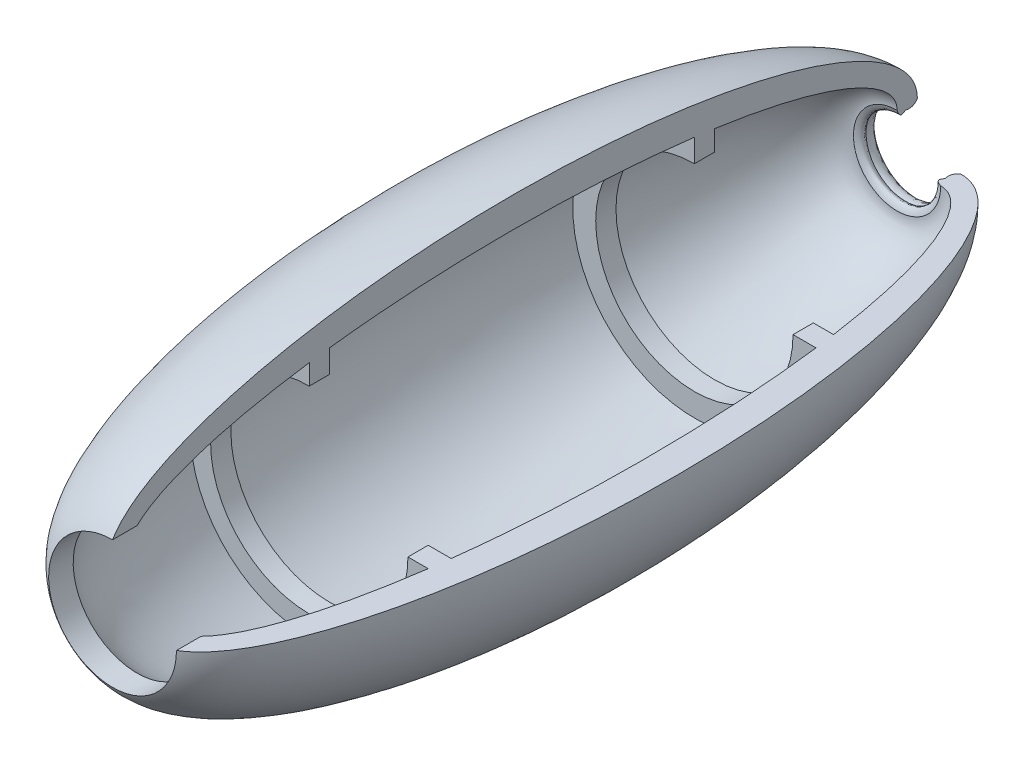
ISO-10303-21;
HEADER;
FILE_DESCRIPTION(('STEP AP214'),'2;1');
FILE_NAME('part.step','',(''),(''),'','','');
FILE_SCHEMA(('AUTOMOTIVE_DESIGN { 1 0 10303 214 1 1 1 1 }'));
ENDSEC;
DATA;
#1=APPLICATION_CONTEXT('core data for automotive mechanical design processes');
#2=APPLICATION_PROTOCOL_DEFINITION('international standard','automotive_design',2000,#1);
#3=PRODUCT_CONTEXT('',#1,'mechanical');
#4=PRODUCT('Part','Part','',(#3));
#5=PRODUCT_RELATED_PRODUCT_CATEGORY('part','',(#4));
#6=PRODUCT_DEFINITION_FORMATION('','',#4);
#7=PRODUCT_DEFINITION_CONTEXT('part definition',#1,'design');
#8=PRODUCT_DEFINITION('design','',#6,#7);
#9=PRODUCT_DEFINITION_SHAPE('','',#8);
#10=(LENGTH_UNIT() NAMED_UNIT(*) SI_UNIT(.MILLI.,.METRE.));
#11=(NAMED_UNIT(*) PLANE_ANGLE_UNIT() SI_UNIT($,.RADIAN.));
#12=(NAMED_UNIT(*) SI_UNIT($,.STERADIAN.) SOLID_ANGLE_UNIT());
#13=UNCERTAINTY_MEASURE_WITH_UNIT(LENGTH_MEASURE(1.E-05),#10,'distance_accuracy_value','');
#14=(GEOMETRIC_REPRESENTATION_CONTEXT(3) GLOBAL_UNCERTAINTY_ASSIGNED_CONTEXT((#13)) GLOBAL_UNIT_ASSIGNED_CONTEXT((#10,
#11,#12)) REPRESENTATION_CONTEXT('',''));
#15=CARTESIAN_POINT('',(0.,0.,0.));
#16=DIRECTION('',(0.,0.,1.));
#17=DIRECTION('',(1.,0.,0.));
#18=AXIS2_PLACEMENT_3D('',#15,#16,#17);
#19=CARTESIAN_POINT('',(9.76134481709585,-10.7699999999999,-115.746595300392));
#20=CARTESIAN_POINT('',(9.13579509543337,-10.7699999999999,-114.892603243976));
#21=CARTESIAN_POINT('',(8.81093699792472,-10.7699999999999,-114.264623631465));
#22=CARTESIAN_POINT('',(10.77,-10.7699999999999,-113.639238781373));
#23=B_SPLINE_CURVE_WITH_KNOTS('',3,(#19,#20,#21,#22),.UNSPECIFIED.,.F.,.F.,(4,4),
(0.465469081089882,1.),.UNSPECIFIED.);
#24=CARTESIAN_POINT('',(0.,-10.77,-129.717244309363));
#25=DIRECTION('',(0.,0.,-1.));
#26=AXIS1_PLACEMENT('',#24,#25);
#27=SURFACE_OF_REVOLUTION('',#23,#26);
#28=CARTESIAN_POINT('',(0.,-10.77,-115.746595300392));
#29=DIRECTION('',(0.,0.,-1.));
#30=DIRECTION('',(-1.,0.,0.));
#31=AXIS2_PLACEMENT_3D('',#28,#29,#30);
#32=CIRCLE('',#31,9.76134481709585);
#33=CARTESIAN_POINT('',(9.76134481709585,-10.7699999999999,-115.746595300392));
#34=VERTEX_POINT('',#33);
#35=CARTESIAN_POINT('',(0.,-1.00865518290415,-115.746595300392));
#36=VERTEX_POINT('',#35);
#37=EDGE_CURVE('E11',#34,#36,#32,.T.);
#38=ORIENTED_EDGE('',*,*,#37,.T.);
#39=CARTESIAN_POINT('',(0.,-1.00865518290415,-115.746595300392));
#40=CARTESIAN_POINT('',(0.,-1.63420490456663,-114.892603243976));
#41=CARTESIAN_POINT('',(0.,-1.95906300207528,-114.264623631465));
#42=CARTESIAN_POINT('',(0.,0.,-113.639238781373));
#43=B_SPLINE_CURVE_WITH_KNOTS('',3,(#39,#40,#41,#42),.UNSPECIFIED.,.F.,.F.,(4,4),
(0.465469081089882,1.),.UNSPECIFIED.);
#44=CARTESIAN_POINT('',(0.,0.,-113.639238781373));
#45=VERTEX_POINT('',#44);
#46=EDGE_CURVE('E131',#36,#45,#43,.T.);
#47=ORIENTED_EDGE('',*,*,#46,.T.);
#48=CARTESIAN_POINT('',(0.,-10.77,-113.639238781373));
#49=DIRECTION('',(0.,0.,-1.));
#50=DIRECTION('',(-1.,0.,0.));
#51=AXIS2_PLACEMENT_3D('',#48,#49,#50);
#52=CIRCLE('',#51,10.77);
#53=CARTESIAN_POINT('',(10.77,-10.7699999999999,-113.639238781373));
#54=VERTEX_POINT('',#53);
#55=EDGE_CURVE('E52',#54,#45,#52,.T.);
#56=ORIENTED_EDGE('',*,*,#55,.F.);
#57=EDGE_CURVE('E133',#34,#54,#23,.T.);
#58=ORIENTED_EDGE('',*,*,#57,.F.);
#59=EDGE_LOOP('',(#38,#47,#56,#58));
#60=FACE_BOUND('',#59,.T.);
#61=ADVANCED_FACE('F36',(#60),#27,.T.);
#62=CARTESIAN_POINT('',(10.77,-10.7699999999999,-118.639238781373));
#63=CARTESIAN_POINT('',(9.74890119252546,-10.7699999999999,-117.988045153487));
#64=CARTESIAN_POINT('',(9.41268272837757,-10.7699999999999,-117.023830915694));
#65=CARTESIAN_POINT('',(9.76134481709585,-10.7699999999999,-115.746595300392));
#66=B_SPLINE_CURVE_WITH_KNOTS('',3,(#62,#63,#64,#65),.UNSPECIFIED.,.F.,.F.,(4,4),(0.,
0.670728868825447),.UNSPECIFIED.);
#67=CARTESIAN_POINT('',(0.,-10.77,-129.717244309363));
#68=DIRECTION('',(0.,0.,-1.));
#69=AXIS1_PLACEMENT('',#67,#68);
#70=SURFACE_OF_REVOLUTION('',#66,#69);
#71=CARTESIAN_POINT('',(0.,-10.77,-118.639238781373));
#72=DIRECTION('',(0.,0.,-1.));
#73=DIRECTION('',(-1.,0.,0.));
#74=AXIS2_PLACEMENT_3D('',#71,#72,#73);
#75=CIRCLE('',#74,10.77);
#76=CARTESIAN_POINT('',(10.77,-10.7699999999999,-118.639238781373));
#77=VERTEX_POINT('',#76);
#78=CARTESIAN_POINT('',(0.,0.,-118.639238781373));
#79=VERTEX_POINT('',#78);
#80=EDGE_CURVE('E45',#77,#79,#75,.T.);
#81=ORIENTED_EDGE('',*,*,#80,.T.);
#82=CARTESIAN_POINT('',(0.,0.,-118.639238781373));
#83=CARTESIAN_POINT('',(0.,-1.02109880747454,-117.988045153487));
#84=CARTESIAN_POINT('',(0.,-1.35731727162243,-117.023830915694));
#85=CARTESIAN_POINT('',(0.,-1.00865518290415,-115.746595300392));
#86=B_SPLINE_CURVE_WITH_KNOTS('',3,(#82,#83,#84,#85),.UNSPECIFIED.,.F.,.F.,(4,4),(0.,
0.670728868825447),.UNSPECIFIED.);
#87=EDGE_CURVE('E142',#79,#36,#86,.T.);
#88=ORIENTED_EDGE('',*,*,#87,.T.);
#89=ORIENTED_EDGE('',*,*,#37,.F.);
#90=EDGE_CURVE('E189',#77,#34,#66,.T.);
#91=ORIENTED_EDGE('',*,*,#90,.F.);
#92=EDGE_LOOP('',(#81,#88,#89,#91));
#93=FACE_BOUND('',#92,.T.);
#94=ADVANCED_FACE('F38',(#93),#70,.T.);
#95=CARTESIAN_POINT('',(10.77,-10.7699999999999,-18.6392387813734));
#96=DIRECTION('',(0.,-1.,0.));
#97=DIRECTION('',(0.,0.,-1.));
#98=AXIS2_PLACEMENT_3D('',#95,#96,#97);
#99=ELLIPSE('',#98,100.,29.2943752517269);
#100=TRIMMED_CURVE('',#99,(PARAMETER_VALUE(-0.376477946905807)),
(PARAMETER_VALUE(3.5180706004956)),.T.,.PARAMETER.);
#101=CARTESIAN_POINT('',(0.,-10.77,-129.717244309363));
#102=DIRECTION('',(0.,0.,-1.));
#103=AXIS1_PLACEMENT('',#101,#102);
#104=SURFACE_OF_REVOLUTION('',#100,#103);
#105=CARTESIAN_POINT('',(0.,-10.77,79.893391231543));
#106=DIRECTION('',(0.,0.,-1.));
#107=DIRECTION('',(-1.,0.,0.));
#108=AXIS2_PLACEMENT_3D('',#105,#106,#107);
#109=CIRCLE('',#108,15.77);
#110=CARTESIAN_POINT('',(15.77,-10.7699999999998,79.8933912315431));
#111=VERTEX_POINT('',#110);
#112=CARTESIAN_POINT('',(0.,5.,79.8933912315431));
#113=VERTEX_POINT('',#112);
#114=EDGE_CURVE('E233',#111,#113,#109,.T.);
#115=ORIENTED_EDGE('',*,*,#114,.T.);
#116=CARTESIAN_POINT('',(0.,0.,-18.6392387813734));
#117=DIRECTION('',(1.,0.,0.));
#118=DIRECTION('',(0.,0.,-1.));
#119=AXIS2_PLACEMENT_3D('',#116,#117,#118);
#120=ELLIPSE('',#119,100.,29.2943752517269);
#121=EDGE_CURVE('E147',#79,#113,#120,.T.);
#122=ORIENTED_EDGE('',*,*,#121,.F.);
#123=ORIENTED_EDGE('',*,*,#80,.F.);
#124=EDGE_CURVE('E238',#77,#111,#99,.T.);
#125=ORIENTED_EDGE('',*,*,#124,.T.);
#126=EDGE_LOOP('',(#115,#122,#123,#125));
#127=FACE_BOUND('',#126,.T.);
#128=ADVANCED_FACE('F236',(#127),#104,.F.);
#129=CARTESIAN_POINT('',(0.,-10.77,-129.717244309363));
#130=DIRECTION('',(0.,0.,-1.));
#131=DIRECTION('',(-1.,0.,0.));
#132=AXIS2_PLACEMENT_3D('',#129,#130,#131);
#133=CYLINDRICAL_SURFACE('',#132,15.77);
#134=CARTESIAN_POINT('',(0.,-10.77,73.837058596387));
#135=DIRECTION('',(0.,0.,-1.));
#136=DIRECTION('',(-1.,0.,0.));
#137=AXIS2_PLACEMENT_3D('',#134,#135,#136);
#138=CIRCLE('',#137,15.77);
#139=CARTESIAN_POINT('',(15.77,-10.7699999999998,73.837058596387));
#140=VERTEX_POINT('',#139);
#141=CARTESIAN_POINT('',(0.,5.,73.837058596387));
#142=VERTEX_POINT('',#141);
#143=EDGE_CURVE('E231',#140,#142,#138,.T.);
#144=ORIENTED_EDGE('',*,*,#143,.T.);
#145=DIRECTION('',(0.,0.,-1.));
#146=VECTOR('',#145,1.);
#147=CARTESIAN_POINT('',(0.,5.,0.));
#148=LINE('',#147,#146);
#149=EDGE_CURVE('E149',#113,#142,#148,.T.);
#150=ORIENTED_EDGE('',*,*,#149,.F.);
#151=ORIENTED_EDGE('',*,*,#114,.F.);
#152=DIRECTION('',(0.,0.,-1.));
#153=VECTOR('',#152,1.);
#154=CARTESIAN_POINT('',(15.77,-10.7699999999998,0.));
#155=LINE('',#154,#153);
#156=EDGE_CURVE('E245',#111,#140,#155,.T.);
#157=ORIENTED_EDGE('',*,*,#156,.T.);
#158=EDGE_LOOP('',(#144,#150,#151,#157));
#159=FACE_BOUND('',#158,.T.);
#160=ADVANCED_FACE('F244',(#159),#133,.F.);
#161=CARTESIAN_POINT('',(10.77,-10.7699999999999,-18.6392387813734));
#162=DIRECTION('',(0.,-1.,0.));
#163=DIRECTION('',(0.,0.,-1.));
#164=AXIS2_PLACEMENT_3D('',#161,#162,#163);
#165=ELLIPSE('',#164,95.,21.8374204680665);
#166=TRIMMED_CURVE('',#165,(PARAMETER_VALUE(-0.51575309112762)),
(PARAMETER_VALUE(3.65734574471741)),.T.,.PARAMETER.);
#167=CARTESIAN_POINT('',(0.,-10.77,-129.717244309363));
#168=DIRECTION('',(0.,0.,-1.));
#169=AXIS1_PLACEMENT('',#167,#168);
#170=SURFACE_OF_REVOLUTION('',#166,#169);
#171=CARTESIAN_POINT('',(0.,-10.77,31.3607612186266));
#172=DIRECTION('',(0.,0.,-1.));
#173=DIRECTION('',(-1.,0.,0.));
#174=AXIS2_PLACEMENT_3D('',#171,#172,#173);
#175=CIRCLE('',#174,29.3381223447206);
#176=CARTESIAN_POINT('',(29.3381223447206,-10.7699999999997,31.3607612186266));
#177=VERTEX_POINT('',#176);
#178=CARTESIAN_POINT('',(0.,18.5681223447206,31.3607612186266));
#179=VERTEX_POINT('',#178);
#180=EDGE_CURVE('E229',#177,#179,#175,.T.);
#181=ORIENTED_EDGE('',*,*,#180,.T.);
#182=CARTESIAN_POINT('',(0.,0.,-18.6392387813734));
#183=DIRECTION('',(1.,0.,0.));
#184=DIRECTION('',(0.,0.,-1.));
#185=AXIS2_PLACEMENT_3D('',#182,#183,#184);
#186=ELLIPSE('',#185,95.,21.8374204680665);
#187=EDGE_CURVE('E161',#179,#142,#186,.T.);
#188=ORIENTED_EDGE('',*,*,#187,.T.);
#189=ORIENTED_EDGE('',*,*,#143,.F.);
#190=EDGE_CURVE('E250',#177,#140,#165,.T.);
#191=ORIENTED_EDGE('',*,*,#190,.F.);
#192=EDGE_LOOP('',(#181,#188,#189,#191));
#193=FACE_BOUND('',#192,.T.);
#194=ADVANCED_FACE('F249',(#193),#170,.T.);
#195=CARTESIAN_POINT('',(10.77,-10.7699999999999,31.3607612186266));
#196=DIRECTION('',(0.,0.,1.));
#197=DIRECTION('',(1.,0.,0.));
#198=AXIS2_PLACEMENT_3D('',#195,#196,#197);
#199=PLANE('',#198);
#200=CARTESIAN_POINT('',(0.,-10.77,31.3607612186266));
#201=DIRECTION('',(0.,0.,-1.));
#202=DIRECTION('',(-1.,0.,0.));
#203=AXIS2_PLACEMENT_3D('',#200,#201,#202);
#204=CIRCLE('',#203,24.3381223447206);
#205=CARTESIAN_POINT('',(24.3381223447206,-10.7699999999997,31.3607612186266));
#206=VERTEX_POINT('',#205);
#207=CARTESIAN_POINT('',(0.,13.5681223447206,31.3607612186266));
#208=VERTEX_POINT('',#207);
#209=EDGE_CURVE('E227',#206,#208,#204,.T.);
#210=ORIENTED_EDGE('',*,*,#209,.T.);
#211=DIRECTION('',(0.,-1.,0.));
#212=VECTOR('',#211,1.);
#213=CARTESIAN_POINT('',(0.,0.,31.3607612186267));
#214=LINE('',#213,#212);
#215=EDGE_CURVE('E164',#179,#208,#214,.T.);
#216=ORIENTED_EDGE('',*,*,#215,.F.);
#217=ORIENTED_EDGE('',*,*,#180,.F.);
#218=DIRECTION('',(-1.,0.,0.));
#219=VECTOR('',#218,1.);
#220=CARTESIAN_POINT('',(10.77,-10.7699999999999,31.3607612186267));
#221=LINE('',#220,#219);
#222=EDGE_CURVE('E257',#177,#206,#221,.T.);
#223=ORIENTED_EDGE('',*,*,#222,.T.);
#224=EDGE_LOOP('',(#210,#216,#217,#223));
#225=FACE_BOUND('',#224,.T.);
#226=ADVANCED_FACE('F255',(#225),#199,.T.);
#227=CARTESIAN_POINT('',(0.,-10.77,-129.717244309363));
#228=DIRECTION('',(0.,0.,-1.));
#229=DIRECTION('',(-1.,0.,0.));
#230=AXIS2_PLACEMENT_3D('',#227,#228,#229);
#231=CYLINDRICAL_SURFACE('',#230,24.3381223447206);
#232=CARTESIAN_POINT('',(0.,-10.77,26.3607612186267));
#233=DIRECTION('',(0.,0.,-1.));
#234=DIRECTION('',(-1.,0.,0.));
#235=AXIS2_PLACEMENT_3D('',#232,#233,#234);
#236=CIRCLE('',#235,24.3381223447206);
#237=CARTESIAN_POINT('',(24.3381223447206,-10.7699999999997,26.3607612186266));
#238=VERTEX_POINT('',#237);
#239=CARTESIAN_POINT('',(0.,13.5681223447206,26.3607612186266));
#240=VERTEX_POINT('',#239);
#241=EDGE_CURVE('E225',#238,#240,#236,.T.);
#242=ORIENTED_EDGE('',*,*,#241,.T.);
#243=DIRECTION('',(0.,0.,-1.));
#244=VECTOR('',#243,1.);
#245=CARTESIAN_POINT('',(0.,13.5681223447206,0.));
#246=LINE('',#245,#244);
#247=EDGE_CURVE('E167',#208,#240,#246,.T.);
#248=ORIENTED_EDGE('',*,*,#247,.F.);
#249=ORIENTED_EDGE('',*,*,#209,.F.);
#250=DIRECTION('',(0.,0.,-1.));
#251=VECTOR('',#250,1.);
#252=CARTESIAN_POINT('',(24.3381223447206,-10.7699999999997,0.));
#253=LINE('',#252,#251);
#254=EDGE_CURVE('E262',#206,#238,#253,.T.);
#255=ORIENTED_EDGE('',*,*,#254,.T.);
#256=EDGE_LOOP('',(#242,#248,#249,#255));
#257=FACE_BOUND('',#256,.T.);
#258=ADVANCED_FACE('F261',(#257),#231,.F.);
#259=CARTESIAN_POINT('',(10.77,-10.7699999999999,26.3607612186266));
#260=DIRECTION('',(0.,0.,1.));
#261=DIRECTION('',(1.,0.,0.));
#262=AXIS2_PLACEMENT_3D('',#259,#260,#261);
#263=PLANE('',#262);
#264=CARTESIAN_POINT('',(0.,-10.77,26.3607612186267));
#265=DIRECTION('',(0.,0.,-1.));
#266=DIRECTION('',(-1.,0.,0.));
#267=AXIS2_PLACEMENT_3D('',#264,#265,#266);
#268=CIRCLE('',#267,30.0021018823666);
#269=CARTESIAN_POINT('',(30.0021018823666,-10.7699999999997,26.3607612186266));
#270=VERTEX_POINT('',#269);
#271=CARTESIAN_POINT('',(0.,19.2321018823666,26.3607612186266));
#272=VERTEX_POINT('',#271);
#273=EDGE_CURVE('E223',#270,#272,#268,.T.);
#274=ORIENTED_EDGE('',*,*,#273,.T.);
#275=DIRECTION('',(0.,-1.,0.));
#276=VECTOR('',#275,1.);
#277=CARTESIAN_POINT('',(0.,0.,26.3607612186266));
#278=LINE('',#277,#276);
#279=EDGE_CURVE('E170',#272,#240,#278,.T.);
#280=ORIENTED_EDGE('',*,*,#279,.T.);
#281=ORIENTED_EDGE('',*,*,#241,.F.);
#282=DIRECTION('',(-1.,0.,0.));
#283=VECTOR('',#282,1.);
#284=CARTESIAN_POINT('',(10.77,-10.7699999999999,26.3607612186266));
#285=LINE('',#284,#283);
#286=EDGE_CURVE('E269',#270,#238,#285,.T.);
#287=ORIENTED_EDGE('',*,*,#286,.F.);
#288=EDGE_LOOP('',(#274,#280,#281,#287));
#289=FACE_BOUND('',#288,.T.);
#290=ADVANCED_FACE('F267',(#289),#263,.F.);
#291=CARTESIAN_POINT('',(10.77,-10.7699999999999,-18.6392387813734));
#292=DIRECTION('',(0.,-1.,0.));
#293=DIRECTION('',(0.,0.,-1.));
#294=AXIS2_PLACEMENT_3D('',#291,#292,#293);
#295=ELLIPSE('',#294,94.9595285288478,21.8401139349948);
#296=TRIMMED_CURVE('',#295,(PARAMETER_VALUE(-0.515683174186846)),
(PARAMETER_VALUE(3.65727582777664)),.T.,.PARAMETER.);
#297=CARTESIAN_POINT('',(0.,-10.77,-129.717244309363));
#298=DIRECTION('',(0.,0.,-1.));
#299=AXIS1_PLACEMENT('',#297,#298);
#300=SURFACE_OF_REVOLUTION('',#296,#299);
#301=CARTESIAN_POINT('',(0.,-10.77,-63.6392387813734));
#302=DIRECTION('',(0.,0.,-1.));
#303=DIRECTION('',(-1.,0.,0.));
#304=AXIS2_PLACEMENT_3D('',#301,#302,#303);
#305=CIRCLE('',#304,30.0021018823666);
#306=CARTESIAN_POINT('',(30.0021018823666,-10.7699999999997,-63.6392387813734));
#307=VERTEX_POINT('',#306);
#308=CARTESIAN_POINT('',(0.,19.2321018823666,-63.6392387813734));
#309=VERTEX_POINT('',#308);
#310=EDGE_CURVE('E221',#307,#309,#305,.T.);
#311=ORIENTED_EDGE('',*,*,#310,.T.);
#312=CARTESIAN_POINT('',(0.,0.,-18.6392387813734));
#313=DIRECTION('',(1.,0.,0.));
#314=DIRECTION('',(0.,0.,-1.));
#315=AXIS2_PLACEMENT_3D('',#312,#313,#314);
#316=ELLIPSE('',#315,94.9595285288478,21.8401139349948);
#317=EDGE_CURVE('E173',#309,#272,#316,.T.);
#318=ORIENTED_EDGE('',*,*,#317,.T.);
#319=ORIENTED_EDGE('',*,*,#273,.F.);
#320=EDGE_CURVE('E274',#307,#270,#295,.T.);
#321=ORIENTED_EDGE('',*,*,#320,.F.);
#322=EDGE_LOOP('',(#311,#318,#319,#321));
#323=FACE_BOUND('',#322,.T.);
#324=ADVANCED_FACE('F273',(#323),#300,.T.);
#325=CARTESIAN_POINT('',(10.77,-10.7699999999999,-63.6392387813734));
#326=DIRECTION('',(0.,0.,1.));
#327=DIRECTION('',(1.,0.,0.));
#328=AXIS2_PLACEMENT_3D('',#325,#326,#327);
#329=PLANE('',#328);
#330=CARTESIAN_POINT('',(0.,-10.77,-63.6392387813734));
#331=DIRECTION('',(0.,0.,-1.));
#332=DIRECTION('',(-1.,0.,0.));
#333=AXIS2_PLACEMENT_3D('',#330,#331,#332);
#334=CIRCLE('',#333,24.3381223447206);
#335=CARTESIAN_POINT('',(24.3381223447206,-10.7699999999997,-63.6392387813734));
#336=VERTEX_POINT('',#335);
#337=CARTESIAN_POINT('',(0.,13.5681223447206,-63.6392387813734));
#338=VERTEX_POINT('',#337);
#339=EDGE_CURVE('E219',#336,#338,#334,.T.);
#340=ORIENTED_EDGE('',*,*,#339,.T.);
#341=DIRECTION('',(0.,-1.,0.));
#342=VECTOR('',#341,1.);
#343=CARTESIAN_POINT('',(0.,0.,-63.6392387813734));
#344=LINE('',#343,#342);
#345=EDGE_CURVE('E176',#309,#338,#344,.T.);
#346=ORIENTED_EDGE('',*,*,#345,.F.);
#347=ORIENTED_EDGE('',*,*,#310,.F.);
#348=DIRECTION('',(-1.,0.,0.));
#349=VECTOR('',#348,1.);
#350=CARTESIAN_POINT('',(10.77,-10.7699999999999,-63.6392387813734));
#351=LINE('',#350,#349);
#352=EDGE_CURVE('E281',#307,#336,#351,.T.);
#353=ORIENTED_EDGE('',*,*,#352,.T.);
#354=EDGE_LOOP('',(#340,#346,#347,#353));
#355=FACE_BOUND('',#354,.T.);
#356=ADVANCED_FACE('F279',(#355),#329,.T.);
#357=CARTESIAN_POINT('',(0.,-10.77,-129.717244309363));
#358=DIRECTION('',(0.,0.,-1.));
#359=DIRECTION('',(-1.,0.,0.));
#360=AXIS2_PLACEMENT_3D('',#357,#358,#359);
#361=CYLINDRICAL_SURFACE('',#360,24.3381223447206);
#362=CARTESIAN_POINT('',(0.,-10.77,-68.6392387813734));
#363=DIRECTION('',(0.,0.,-1.));
#364=DIRECTION('',(-1.,0.,0.));
#365=AXIS2_PLACEMENT_3D('',#362,#363,#364);
#366=CIRCLE('',#365,24.3381223447206);
#367=CARTESIAN_POINT('',(24.3381223447206,-10.7699999999997,-68.6392387813734));
#368=VERTEX_POINT('',#367);
#369=CARTESIAN_POINT('',(0.,13.5681223447206,-68.6392387813734));
#370=VERTEX_POINT('',#369);
#371=EDGE_CURVE('E217',#368,#370,#366,.T.);
#372=ORIENTED_EDGE('',*,*,#371,.T.);
#373=DIRECTION('',(0.,0.,1.));
#374=VECTOR('',#373,1.);
#375=CARTESIAN_POINT('',(0.,13.5681223447206,0.));
#376=LINE('',#375,#374);
#377=EDGE_CURVE('E179',#370,#338,#376,.T.);
#378=ORIENTED_EDGE('',*,*,#377,.T.);
#379=ORIENTED_EDGE('',*,*,#339,.F.);
#380=DIRECTION('',(0.,0.,1.));
#381=VECTOR('',#380,1.);
#382=CARTESIAN_POINT('',(24.3381223447206,-10.7699999999997,0.));
#383=LINE('',#382,#381);
#384=EDGE_CURVE('E286',#368,#336,#383,.T.);
#385=ORIENTED_EDGE('',*,*,#384,.F.);
#386=EDGE_LOOP('',(#372,#378,#379,#385));
#387=FACE_BOUND('',#386,.T.);
#388=ADVANCED_FACE('F285',(#387),#361,.F.);
#389=CARTESIAN_POINT('',(10.77,-10.7699999999999,-68.6392387813734));
#390=DIRECTION('',(0.,0.,1.));
#391=DIRECTION('',(1.,0.,0.));
#392=AXIS2_PLACEMENT_3D('',#389,#390,#391);
#393=PLANE('',#392);
#394=CARTESIAN_POINT('',(0.,-10.77,-68.6392387813734));
#395=DIRECTION('',(0.,0.,-1.));
#396=DIRECTION('',(-1.,0.,0.));
#397=AXIS2_PLACEMENT_3D('',#394,#395,#396);
#398=CIRCLE('',#397,29.3381223447206);
#399=CARTESIAN_POINT('',(29.3381223447206,-10.7699999999997,-68.6392387813734));
#400=VERTEX_POINT('',#399);
#401=CARTESIAN_POINT('',(0.,18.5681223447206,-68.6392387813734));
#402=VERTEX_POINT('',#401);
#403=EDGE_CURVE('E60',#400,#402,#398,.T.);
#404=ORIENTED_EDGE('',*,*,#403,.T.);
#405=DIRECTION('',(0.,-1.,0.));
#406=VECTOR('',#405,1.);
#407=CARTESIAN_POINT('',(0.,0.,-68.6392387813734));
#408=LINE('',#407,#406);
#409=EDGE_CURVE('E182',#402,#370,#408,.T.);
#410=ORIENTED_EDGE('',*,*,#409,.T.);
#411=ORIENTED_EDGE('',*,*,#371,.F.);
#412=DIRECTION('',(-1.,0.,0.));
#413=VECTOR('',#412,1.);
#414=CARTESIAN_POINT('',(10.77,-10.7699999999999,-68.6392387813734));
#415=LINE('',#414,#413);
#416=EDGE_CURVE('E213',#400,#368,#415,.T.);
#417=ORIENTED_EDGE('',*,*,#416,.F.);
#418=EDGE_LOOP('',(#404,#410,#411,#417));
#419=FACE_BOUND('',#418,.T.);
#420=ADVANCED_FACE('F207',(#419),#393,.F.);
#421=CARTESIAN_POINT('',(10.77,-10.7699999999999,-18.6392387813734));
#422=DIRECTION('',(0.,1.,0.));
#423=DIRECTION('',(0.,0.,1.));
#424=AXIS2_PLACEMENT_3D('',#421,#422,#423);
#425=ELLIPSE('',#424,95.,21.8374204680665);
#426=TRIMMED_CURVE('',#425,(PARAMETER_VALUE(-0.51575309112762)),
(PARAMETER_VALUE(3.65734574471741)),.T.,.PARAMETER.);
#427=CARTESIAN_POINT('',(0.,-10.77,-129.717244309363));
#428=DIRECTION('',(0.,0.,-1.));
#429=AXIS1_PLACEMENT('',#427,#428);
#430=SURFACE_OF_REVOLUTION('',#426,#429);
#431=EDGE_CURVE('E209',#400,#54,#425,.T.);
#432=ORIENTED_EDGE('',*,*,#431,.T.);
#433=ORIENTED_EDGE('',*,*,#55,.T.);
#434=CARTESIAN_POINT('',(0.,0.,-18.6392387813734));
#435=DIRECTION('',(-1.,0.,0.));
#436=DIRECTION('',(0.,0.,1.));
#437=AXIS2_PLACEMENT_3D('',#434,#435,#436);
#438=ELLIPSE('',#437,95.,21.8374204680665);
#439=EDGE_CURVE('E145',#402,#45,#438,.T.);
#440=ORIENTED_EDGE('',*,*,#439,.F.);
#441=ORIENTED_EDGE('',*,*,#403,.F.);
#442=EDGE_LOOP('',(#432,#433,#440,#441));
#443=FACE_BOUND('',#442,.T.);
#444=ADVANCED_FACE('F203',(#443),#430,.F.);
#445=CARTESIAN_POINT('',(10.77,-10.7699999999999,0.));
#446=DIRECTION('',(0.,-1.,0.));
#447=DIRECTION('',(0.,0.,-1.));
#448=AXIS2_PLACEMENT_3D('',#445,#446,#447);
#449=PLANE('',#448);
#450=ORIENTED_EDGE('',*,*,#57,.T.);
#451=ORIENTED_EDGE('',*,*,#431,.F.);
#452=ORIENTED_EDGE('',*,*,#416,.T.);
#453=ORIENTED_EDGE('',*,*,#384,.T.);
#454=ORIENTED_EDGE('',*,*,#352,.F.);
#455=ORIENTED_EDGE('',*,*,#320,.T.);
#456=ORIENTED_EDGE('',*,*,#286,.T.);
#457=ORIENTED_EDGE('',*,*,#254,.F.);
#458=ORIENTED_EDGE('',*,*,#222,.F.);
#459=ORIENTED_EDGE('',*,*,#190,.T.);
#460=ORIENTED_EDGE('',*,*,#156,.F.);
#461=ORIENTED_EDGE('',*,*,#124,.F.);
#462=ORIENTED_EDGE('',*,*,#90,.T.);
#463=EDGE_LOOP('',(#450,#451,#452,#453,#454,#455,#456,#457,#458,#459,#460,#461,#462));
#464=FACE_BOUND('',#463,.T.);
#465=ADVANCED_FACE('F201',(#464),#449,.F.);
#466=CARTESIAN_POINT('',(0.,0.,0.));
#467=DIRECTION('',(1.,0.,0.));
#468=DIRECTION('',(0.,0.,-1.));
#469=AXIS2_PLACEMENT_3D('',#466,#467,#468);
#470=PLANE('',#469);
#471=ORIENTED_EDGE('',*,*,#46,.F.);
#472=ORIENTED_EDGE('',*,*,#87,.F.);
#473=ORIENTED_EDGE('',*,*,#121,.T.);
#474=ORIENTED_EDGE('',*,*,#149,.T.);
#475=ORIENTED_EDGE('',*,*,#187,.F.);
#476=ORIENTED_EDGE('',*,*,#215,.T.);
#477=ORIENTED_EDGE('',*,*,#247,.T.);
#478=ORIENTED_EDGE('',*,*,#279,.F.);
#479=ORIENTED_EDGE('',*,*,#317,.F.);
#480=ORIENTED_EDGE('',*,*,#345,.T.);
#481=ORIENTED_EDGE('',*,*,#377,.F.);
#482=ORIENTED_EDGE('',*,*,#409,.F.);
#483=ORIENTED_EDGE('',*,*,#439,.T.);
#484=EDGE_LOOP('',(#471,#472,#473,#474,#475,#476,#477,#478,#479,#480,#481,#482,#483));
#485=FACE_BOUND('',#484,.T.);
#486=ADVANCED_FACE('F140',(#485),#470,.T.);
#487=CLOSED_SHELL('',(#61,#94,#128,#160,#194,#226,#258,#290,#324,#356,#388,#420,#444,#465,#486));
#488=MANIFOLD_SOLID_BREP('B2',#487);
#489=ADVANCED_BREP_SHAPE_REPRESENTATION('',(#18,#488),#14);
#490=SHAPE_DEFINITION_REPRESENTATION(#9,#489);
ENDSEC;
END-ISO-10303-21;
